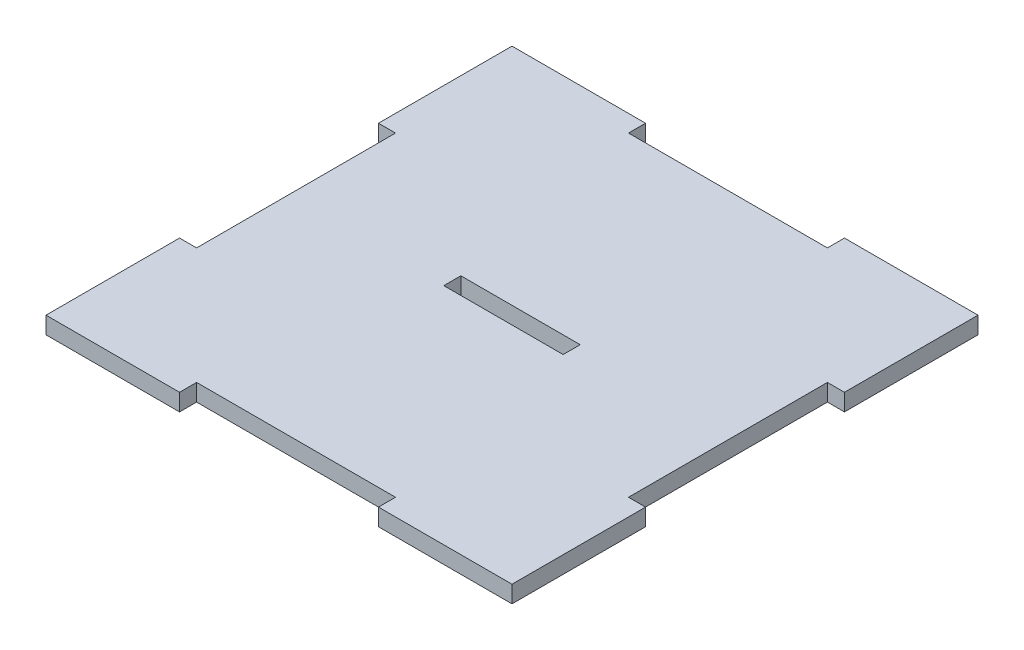
ISO-10303-21;
HEADER;
FILE_DESCRIPTION(('STEP AP214'),'2;1');
FILE_NAME('part.step','',(''),(''),'','','');
FILE_SCHEMA(('AUTOMOTIVE_DESIGN { 1 0 10303 214 1 1 1 1 }'));
ENDSEC;
DATA;
#1=APPLICATION_CONTEXT('core data for automotive mechanical design processes');
#2=APPLICATION_PROTOCOL_DEFINITION('international standard','automotive_design',2000,#1);
#3=PRODUCT_CONTEXT('',#1,'mechanical');
#4=PRODUCT('Part','Part','',(#3));
#5=PRODUCT_RELATED_PRODUCT_CATEGORY('part','',(#4));
#6=PRODUCT_DEFINITION_FORMATION('','',#4);
#7=PRODUCT_DEFINITION_CONTEXT('part definition',#1,'design');
#8=PRODUCT_DEFINITION('design','',#6,#7);
#9=PRODUCT_DEFINITION_SHAPE('','',#8);
#10=(LENGTH_UNIT() NAMED_UNIT(*) SI_UNIT(.MILLI.,.METRE.));
#11=(NAMED_UNIT(*) PLANE_ANGLE_UNIT() SI_UNIT($,.RADIAN.));
#12=(NAMED_UNIT(*) SI_UNIT($,.STERADIAN.) SOLID_ANGLE_UNIT());
#13=UNCERTAINTY_MEASURE_WITH_UNIT(LENGTH_MEASURE(1.E-05),#10,'distance_accuracy_value','');
#14=(GEOMETRIC_REPRESENTATION_CONTEXT(3) GLOBAL_UNCERTAINTY_ASSIGNED_CONTEXT((#13)) GLOBAL_UNIT_ASSIGNED_CONTEXT((#10,
#11,#12)) REPRESENTATION_CONTEXT('',''));
#15=CARTESIAN_POINT('',(0.,0.,0.));
#16=DIRECTION('',(0.,0.,1.));
#17=DIRECTION('',(1.,0.,0.));
#18=AXIS2_PLACEMENT_3D('',#15,#16,#17);
#19=CARTESIAN_POINT('',(41.,3.,-17.5));
#20=DIRECTION('',(-1.,0.,0.));
#21=DIRECTION('',(0.,0.,1.));
#22=AXIS2_PLACEMENT_3D('',#19,#20,#21);
#23=PLANE('',#22);
#24=DIRECTION('',(0.,0.,-1.));
#25=VECTOR('',#24,1.);
#26=CARTESIAN_POINT('',(41.,0.,-17.5));
#27=LINE('',#26,#25);
#28=CARTESIAN_POINT('',(41.,0.,-17.5));
#29=VERTEX_POINT('',#28);
#30=CARTESIAN_POINT('',(41.,0.,-41.));
#31=VERTEX_POINT('',#30);
#32=EDGE_CURVE('E230',#29,#31,#27,.T.);
#33=ORIENTED_EDGE('',*,*,#32,.T.);
#34=DIRECTION('',(0.,-1.,0.));
#35=VECTOR('',#34,1.);
#36=CARTESIAN_POINT('',(41.,3.,-41.));
#37=LINE('',#36,#35);
#38=CARTESIAN_POINT('',(41.,3.,-41.));
#39=VERTEX_POINT('',#38);
#40=EDGE_CURVE('E11',#39,#31,#37,.T.);
#41=ORIENTED_EDGE('',*,*,#40,.F.);
#42=DIRECTION('',(0.,0.,-1.));
#43=VECTOR('',#42,1.);
#44=CARTESIAN_POINT('',(41.,3.,-17.5));
#45=LINE('',#44,#43);
#46=CARTESIAN_POINT('',(41.,3.,-17.5));
#47=VERTEX_POINT('',#46);
#48=EDGE_CURVE('E234',#47,#39,#45,.T.);
#49=ORIENTED_EDGE('',*,*,#48,.F.);
#50=DIRECTION('',(0.,-1.,0.));
#51=VECTOR('',#50,1.);
#52=CARTESIAN_POINT('',(41.,3.,-17.5));
#53=LINE('',#52,#51);
#54=EDGE_CURVE('E276',#47,#29,#53,.T.);
#55=ORIENTED_EDGE('',*,*,#54,.T.);
#56=EDGE_LOOP('',(#33,#41,#49,#55));
#57=FACE_BOUND('',#56,.T.);
#58=ADVANCED_FACE('F37',(#57),#23,.F.);
#59=CARTESIAN_POINT('',(17.5,3.,-41.));
#60=DIRECTION('',(0.,0.,1.));
#61=DIRECTION('',(1.,0.,0.));
#62=AXIS2_PLACEMENT_3D('',#59,#60,#61);
#63=PLANE('',#62);
#64=DIRECTION('',(-1.,0.,0.));
#65=VECTOR('',#64,1.);
#66=CARTESIAN_POINT('',(17.5,0.,-41.));
#67=LINE('',#66,#65);
#68=CARTESIAN_POINT('',(17.5,0.,-41.));
#69=VERTEX_POINT('',#68);
#70=EDGE_CURVE('E279',#31,#69,#67,.T.);
#71=ORIENTED_EDGE('',*,*,#70,.T.);
#72=DIRECTION('',(0.,-1.,0.));
#73=VECTOR('',#72,1.);
#74=CARTESIAN_POINT('',(17.5,3.,-41.));
#75=LINE('',#74,#73);
#76=CARTESIAN_POINT('',(17.5,3.,-41.));
#77=VERTEX_POINT('',#76);
#78=EDGE_CURVE('E44',#77,#69,#75,.T.);
#79=ORIENTED_EDGE('',*,*,#78,.F.);
#80=DIRECTION('',(-1.,0.,0.));
#81=VECTOR('',#80,1.);
#82=CARTESIAN_POINT('',(17.5,3.,-41.));
#83=LINE('',#82,#81);
#84=EDGE_CURVE('E237',#39,#77,#83,.T.);
#85=ORIENTED_EDGE('',*,*,#84,.F.);
#86=ORIENTED_EDGE('',*,*,#40,.T.);
#87=EDGE_LOOP('',(#71,#79,#85,#86));
#88=FACE_BOUND('',#87,.T.);
#89=ADVANCED_FACE('F394',(#88),#63,.F.);
#90=CARTESIAN_POINT('',(17.5,3.,-38.));
#91=DIRECTION('',(1.,0.,0.));
#92=DIRECTION('',(0.,0.,-1.));
#93=AXIS2_PLACEMENT_3D('',#90,#91,#92);
#94=PLANE('',#93);
#95=DIRECTION('',(0.,0.,1.));
#96=VECTOR('',#95,1.);
#97=CARTESIAN_POINT('',(17.5,0.,-38.));
#98=LINE('',#97,#96);
#99=CARTESIAN_POINT('',(17.5,0.,-38.));
#100=VERTEX_POINT('',#99);
#101=EDGE_CURVE('E281',#69,#100,#98,.T.);
#102=ORIENTED_EDGE('',*,*,#101,.T.);
#103=DIRECTION('',(0.,-1.,0.));
#104=VECTOR('',#103,1.);
#105=CARTESIAN_POINT('',(17.5,3.,-38.));
#106=LINE('',#105,#104);
#107=CARTESIAN_POINT('',(17.5,3.,-38.));
#108=VERTEX_POINT('',#107);
#109=EDGE_CURVE('E366',#108,#100,#106,.T.);
#110=ORIENTED_EDGE('',*,*,#109,.F.);
#111=DIRECTION('',(0.,0.,1.));
#112=VECTOR('',#111,1.);
#113=CARTESIAN_POINT('',(17.5,3.,-38.));
#114=LINE('',#113,#112);
#115=EDGE_CURVE('E240',#77,#108,#114,.T.);
#116=ORIENTED_EDGE('',*,*,#115,.F.);
#117=ORIENTED_EDGE('',*,*,#78,.T.);
#118=EDGE_LOOP('',(#102,#110,#116,#117));
#119=FACE_BOUND('',#118,.T.);
#120=ADVANCED_FACE('F373',(#119),#94,.F.);
#121=CARTESIAN_POINT('',(-17.5,3.,-38.));
#122=DIRECTION('',(0.,0.,1.));
#123=DIRECTION('',(1.,0.,0.));
#124=AXIS2_PLACEMENT_3D('',#121,#122,#123);
#125=PLANE('',#124);
#126=DIRECTION('',(-1.,0.,0.));
#127=VECTOR('',#126,1.);
#128=CARTESIAN_POINT('',(-17.5,0.,-38.));
#129=LINE('',#128,#127);
#130=CARTESIAN_POINT('',(-17.5,0.,-38.));
#131=VERTEX_POINT('',#130);
#132=EDGE_CURVE('E283',#100,#131,#129,.T.);
#133=ORIENTED_EDGE('',*,*,#132,.T.);
#134=DIRECTION('',(0.,-1.,0.));
#135=VECTOR('',#134,1.);
#136=CARTESIAN_POINT('',(-17.5,3.,-38.));
#137=LINE('',#136,#135);
#138=CARTESIAN_POINT('',(-17.5,3.,-38.));
#139=VERTEX_POINT('',#138);
#140=EDGE_CURVE('E363',#139,#131,#137,.T.);
#141=ORIENTED_EDGE('',*,*,#140,.F.);
#142=DIRECTION('',(-1.,0.,0.));
#143=VECTOR('',#142,1.);
#144=CARTESIAN_POINT('',(-17.5,3.,-38.));
#145=LINE('',#144,#143);
#146=EDGE_CURVE('E242',#108,#139,#145,.T.);
#147=ORIENTED_EDGE('',*,*,#146,.F.);
#148=ORIENTED_EDGE('',*,*,#109,.T.);
#149=EDGE_LOOP('',(#133,#141,#147,#148));
#150=FACE_BOUND('',#149,.T.);
#151=ADVANCED_FACE('F382',(#150),#125,.F.);
#152=CARTESIAN_POINT('',(-17.5,3.,-41.));
#153=DIRECTION('',(-1.,0.,0.));
#154=DIRECTION('',(0.,0.,1.));
#155=AXIS2_PLACEMENT_3D('',#152,#153,#154);
#156=PLANE('',#155);
#157=DIRECTION('',(0.,0.,-1.));
#158=VECTOR('',#157,1.);
#159=CARTESIAN_POINT('',(-17.5,0.,-41.));
#160=LINE('',#159,#158);
#161=CARTESIAN_POINT('',(-17.5,0.,-41.));
#162=VERTEX_POINT('',#161);
#163=EDGE_CURVE('E285',#131,#162,#160,.T.);
#164=ORIENTED_EDGE('',*,*,#163,.T.);
#165=DIRECTION('',(0.,-1.,0.));
#166=VECTOR('',#165,1.);
#167=CARTESIAN_POINT('',(-17.5,3.,-41.));
#168=LINE('',#167,#166);
#169=CARTESIAN_POINT('',(-17.5,3.,-41.));
#170=VERTEX_POINT('',#169);
#171=EDGE_CURVE('E360',#170,#162,#168,.T.);
#172=ORIENTED_EDGE('',*,*,#171,.F.);
#173=DIRECTION('',(0.,0.,-1.));
#174=VECTOR('',#173,1.);
#175=CARTESIAN_POINT('',(-17.5,3.,-41.));
#176=LINE('',#175,#174);
#177=EDGE_CURVE('E244',#139,#170,#176,.T.);
#178=ORIENTED_EDGE('',*,*,#177,.F.);
#179=ORIENTED_EDGE('',*,*,#140,.T.);
#180=EDGE_LOOP('',(#164,#172,#178,#179));
#181=FACE_BOUND('',#180,.T.);
#182=ADVANCED_FACE('F386',(#181),#156,.F.);
#183=CARTESIAN_POINT('',(-41.,3.,-41.));
#184=DIRECTION('',(0.,0.,1.));
#185=DIRECTION('',(1.,0.,0.));
#186=AXIS2_PLACEMENT_3D('',#183,#184,#185);
#187=PLANE('',#186);
#188=DIRECTION('',(-1.,0.,0.));
#189=VECTOR('',#188,1.);
#190=CARTESIAN_POINT('',(-41.,0.,-41.));
#191=LINE('',#190,#189);
#192=CARTESIAN_POINT('',(-41.,0.,-41.));
#193=VERTEX_POINT('',#192);
#194=EDGE_CURVE('E287',#162,#193,#191,.T.);
#195=ORIENTED_EDGE('',*,*,#194,.T.);
#196=DIRECTION('',(0.,-1.,0.));
#197=VECTOR('',#196,1.);
#198=CARTESIAN_POINT('',(-41.,3.,-41.));
#199=LINE('',#198,#197);
#200=CARTESIAN_POINT('',(-41.,3.,-41.));
#201=VERTEX_POINT('',#200);
#202=EDGE_CURVE('E357',#201,#193,#199,.T.);
#203=ORIENTED_EDGE('',*,*,#202,.F.);
#204=DIRECTION('',(-1.,0.,0.));
#205=VECTOR('',#204,1.);
#206=CARTESIAN_POINT('',(-41.,3.,-41.));
#207=LINE('',#206,#205);
#208=EDGE_CURVE('E246',#170,#201,#207,.T.);
#209=ORIENTED_EDGE('',*,*,#208,.F.);
#210=ORIENTED_EDGE('',*,*,#171,.T.);
#211=EDGE_LOOP('',(#195,#203,#209,#210));
#212=FACE_BOUND('',#211,.T.);
#213=ADVANCED_FACE('F467',(#212),#187,.F.);
#214=CARTESIAN_POINT('',(-41.,3.,-17.5));
#215=DIRECTION('',(1.,0.,0.));
#216=DIRECTION('',(0.,0.,-1.));
#217=AXIS2_PLACEMENT_3D('',#214,#215,#216);
#218=PLANE('',#217);
#219=DIRECTION('',(0.,0.,1.));
#220=VECTOR('',#219,1.);
#221=CARTESIAN_POINT('',(-41.,0.,-17.5));
#222=LINE('',#221,#220);
#223=CARTESIAN_POINT('',(-41.,0.,-17.5));
#224=VERTEX_POINT('',#223);
#225=EDGE_CURVE('E289',#193,#224,#222,.T.);
#226=ORIENTED_EDGE('',*,*,#225,.T.);
#227=DIRECTION('',(0.,-1.,0.));
#228=VECTOR('',#227,1.);
#229=CARTESIAN_POINT('',(-41.,3.,-17.5));
#230=LINE('',#229,#228);
#231=CARTESIAN_POINT('',(-41.,3.,-17.5));
#232=VERTEX_POINT('',#231);
#233=EDGE_CURVE('E354',#232,#224,#230,.T.);
#234=ORIENTED_EDGE('',*,*,#233,.F.);
#235=DIRECTION('',(0.,0.,1.));
#236=VECTOR('',#235,1.);
#237=CARTESIAN_POINT('',(-41.,3.,-17.5));
#238=LINE('',#237,#236);
#239=EDGE_CURVE('E248',#201,#232,#238,.T.);
#240=ORIENTED_EDGE('',*,*,#239,.F.);
#241=ORIENTED_EDGE('',*,*,#202,.T.);
#242=EDGE_LOOP('',(#226,#234,#240,#241));
#243=FACE_BOUND('',#242,.T.);
#244=ADVANCED_FACE('F465',(#243),#218,.F.);
#245=CARTESIAN_POINT('',(-41.,3.,-17.5));
#246=DIRECTION('',(0.,0.,-1.));
#247=DIRECTION('',(-1.,0.,0.));
#248=AXIS2_PLACEMENT_3D('',#245,#246,#247);
#249=PLANE('',#248);
#250=DIRECTION('',(1.,0.,0.));
#251=VECTOR('',#250,1.);
#252=CARTESIAN_POINT('',(-41.,0.,-17.5));
#253=LINE('',#252,#251);
#254=CARTESIAN_POINT('',(-38.,0.,-17.5));
#255=VERTEX_POINT('',#254);
#256=EDGE_CURVE('E291',#224,#255,#253,.T.);
#257=ORIENTED_EDGE('',*,*,#256,.T.);
#258=DIRECTION('',(0.,-1.,0.));
#259=VECTOR('',#258,1.);
#260=CARTESIAN_POINT('',(-38.,3.,-17.5));
#261=LINE('',#260,#259);
#262=CARTESIAN_POINT('',(-38.,3.,-17.5));
#263=VERTEX_POINT('',#262);
#264=EDGE_CURVE('E351',#263,#255,#261,.T.);
#265=ORIENTED_EDGE('',*,*,#264,.F.);
#266=DIRECTION('',(1.,0.,0.));
#267=VECTOR('',#266,1.);
#268=CARTESIAN_POINT('',(-41.,3.,-17.5));
#269=LINE('',#268,#267);
#270=EDGE_CURVE('E250',#232,#263,#269,.T.);
#271=ORIENTED_EDGE('',*,*,#270,.F.);
#272=ORIENTED_EDGE('',*,*,#233,.T.);
#273=EDGE_LOOP('',(#257,#265,#271,#272));
#274=FACE_BOUND('',#273,.T.);
#275=ADVANCED_FACE('F460',(#274),#249,.F.);
#276=CARTESIAN_POINT('',(-38.,3.,-17.5));
#277=DIRECTION('',(1.,0.,0.));
#278=DIRECTION('',(0.,0.,-1.));
#279=AXIS2_PLACEMENT_3D('',#276,#277,#278);
#280=PLANE('',#279);
#281=DIRECTION('',(0.,0.,1.));
#282=VECTOR('',#281,1.);
#283=CARTESIAN_POINT('',(-38.,0.,-17.5));
#284=LINE('',#283,#282);
#285=CARTESIAN_POINT('',(-38.,0.,17.5));
#286=VERTEX_POINT('',#285);
#287=EDGE_CURVE('E293',#255,#286,#284,.T.);
#288=ORIENTED_EDGE('',*,*,#287,.T.);
#289=DIRECTION('',(0.,-1.,0.));
#290=VECTOR('',#289,1.);
#291=CARTESIAN_POINT('',(-38.,3.,17.5));
#292=LINE('',#291,#290);
#293=CARTESIAN_POINT('',(-38.,3.,17.5));
#294=VERTEX_POINT('',#293);
#295=EDGE_CURVE('E348',#294,#286,#292,.T.);
#296=ORIENTED_EDGE('',*,*,#295,.F.);
#297=DIRECTION('',(0.,0.,1.));
#298=VECTOR('',#297,1.);
#299=CARTESIAN_POINT('',(-38.,3.,-17.5));
#300=LINE('',#299,#298);
#301=EDGE_CURVE('E252',#263,#294,#300,.T.);
#302=ORIENTED_EDGE('',*,*,#301,.F.);
#303=ORIENTED_EDGE('',*,*,#264,.T.);
#304=EDGE_LOOP('',(#288,#296,#302,#303));
#305=FACE_BOUND('',#304,.T.);
#306=ADVANCED_FACE('F455',(#305),#280,.F.);
#307=CARTESIAN_POINT('',(-38.,3.,17.5));
#308=DIRECTION('',(0.,0.,1.));
#309=DIRECTION('',(1.,0.,0.));
#310=AXIS2_PLACEMENT_3D('',#307,#308,#309);
#311=PLANE('',#310);
#312=DIRECTION('',(-1.,0.,0.));
#313=VECTOR('',#312,1.);
#314=CARTESIAN_POINT('',(-38.,0.,17.5));
#315=LINE('',#314,#313);
#316=CARTESIAN_POINT('',(-41.,0.,17.5));
#317=VERTEX_POINT('',#316);
#318=EDGE_CURVE('E295',#286,#317,#315,.T.);
#319=ORIENTED_EDGE('',*,*,#318,.T.);
#320=DIRECTION('',(0.,-1.,0.));
#321=VECTOR('',#320,1.);
#322=CARTESIAN_POINT('',(-41.,3.,17.5));
#323=LINE('',#322,#321);
#324=CARTESIAN_POINT('',(-41.,3.,17.5));
#325=VERTEX_POINT('',#324);
#326=EDGE_CURVE('E345',#325,#317,#323,.T.);
#327=ORIENTED_EDGE('',*,*,#326,.F.);
#328=DIRECTION('',(-1.,0.,0.));
#329=VECTOR('',#328,1.);
#330=CARTESIAN_POINT('',(-38.,3.,17.5));
#331=LINE('',#330,#329);
#332=EDGE_CURVE('E254',#294,#325,#331,.T.);
#333=ORIENTED_EDGE('',*,*,#332,.F.);
#334=ORIENTED_EDGE('',*,*,#295,.T.);
#335=EDGE_LOOP('',(#319,#327,#333,#334));
#336=FACE_BOUND('',#335,.T.);
#337=ADVANCED_FACE('F451',(#336),#311,.F.);
#338=CARTESIAN_POINT('',(-41.,3.,41.));
#339=DIRECTION('',(1.,0.,0.));
#340=DIRECTION('',(0.,0.,-1.));
#341=AXIS2_PLACEMENT_3D('',#338,#339,#340);
#342=PLANE('',#341);
#343=DIRECTION('',(0.,0.,1.));
#344=VECTOR('',#343,1.);
#345=CARTESIAN_POINT('',(-41.,0.,41.));
#346=LINE('',#345,#344);
#347=CARTESIAN_POINT('',(-41.,0.,41.));
#348=VERTEX_POINT('',#347);
#349=EDGE_CURVE('E297',#317,#348,#346,.T.);
#350=ORIENTED_EDGE('',*,*,#349,.T.);
#351=DIRECTION('',(0.,-1.,0.));
#352=VECTOR('',#351,1.);
#353=CARTESIAN_POINT('',(-41.,3.,41.));
#354=LINE('',#353,#352);
#355=CARTESIAN_POINT('',(-41.,3.,41.));
#356=VERTEX_POINT('',#355);
#357=EDGE_CURVE('E342',#356,#348,#354,.T.);
#358=ORIENTED_EDGE('',*,*,#357,.F.);
#359=DIRECTION('',(0.,0.,1.));
#360=VECTOR('',#359,1.);
#361=CARTESIAN_POINT('',(-41.,3.,41.));
#362=LINE('',#361,#360);
#363=EDGE_CURVE('E256',#325,#356,#362,.T.);
#364=ORIENTED_EDGE('',*,*,#363,.F.);
#365=ORIENTED_EDGE('',*,*,#326,.T.);
#366=EDGE_LOOP('',(#350,#358,#364,#365));
#367=FACE_BOUND('',#366,.T.);
#368=ADVANCED_FACE('F446',(#367),#342,.F.);
#369=CARTESIAN_POINT('',(-41.,3.,41.));
#370=DIRECTION('',(0.,0.,-1.));
#371=DIRECTION('',(-1.,0.,0.));
#372=AXIS2_PLACEMENT_3D('',#369,#370,#371);
#373=PLANE('',#372);
#374=DIRECTION('',(1.,0.,0.));
#375=VECTOR('',#374,1.);
#376=CARTESIAN_POINT('',(-41.,0.,41.));
#377=LINE('',#376,#375);
#378=CARTESIAN_POINT('',(-17.5,0.,41.));
#379=VERTEX_POINT('',#378);
#380=EDGE_CURVE('E299',#348,#379,#377,.T.);
#381=ORIENTED_EDGE('',*,*,#380,.T.);
#382=DIRECTION('',(0.,-1.,0.));
#383=VECTOR('',#382,1.);
#384=CARTESIAN_POINT('',(-17.5,3.,41.));
#385=LINE('',#384,#383);
#386=CARTESIAN_POINT('',(-17.5,3.,41.));
#387=VERTEX_POINT('',#386);
#388=EDGE_CURVE('E339',#387,#379,#385,.T.);
#389=ORIENTED_EDGE('',*,*,#388,.F.);
#390=DIRECTION('',(1.,0.,0.));
#391=VECTOR('',#390,1.);
#392=CARTESIAN_POINT('',(-41.,3.,41.));
#393=LINE('',#392,#391);
#394=EDGE_CURVE('E258',#356,#387,#393,.T.);
#395=ORIENTED_EDGE('',*,*,#394,.F.);
#396=ORIENTED_EDGE('',*,*,#357,.T.);
#397=EDGE_LOOP('',(#381,#389,#395,#396));
#398=FACE_BOUND('',#397,.T.);
#399=ADVANCED_FACE('F440',(#398),#373,.F.);
#400=CARTESIAN_POINT('',(-17.5,3.,38.));
#401=DIRECTION('',(-1.,0.,0.));
#402=DIRECTION('',(0.,0.,1.));
#403=AXIS2_PLACEMENT_3D('',#400,#401,#402);
#404=PLANE('',#403);
#405=DIRECTION('',(0.,0.,-1.));
#406=VECTOR('',#405,1.);
#407=CARTESIAN_POINT('',(-17.5,0.,38.));
#408=LINE('',#407,#406);
#409=CARTESIAN_POINT('',(-17.5,0.,38.));
#410=VERTEX_POINT('',#409);
#411=EDGE_CURVE('E301',#379,#410,#408,.T.);
#412=ORIENTED_EDGE('',*,*,#411,.T.);
#413=DIRECTION('',(0.,-1.,0.));
#414=VECTOR('',#413,1.);
#415=CARTESIAN_POINT('',(-17.5,3.,38.));
#416=LINE('',#415,#414);
#417=CARTESIAN_POINT('',(-17.5,3.,38.));
#418=VERTEX_POINT('',#417);
#419=EDGE_CURVE('E336',#418,#410,#416,.T.);
#420=ORIENTED_EDGE('',*,*,#419,.F.);
#421=DIRECTION('',(0.,0.,-1.));
#422=VECTOR('',#421,1.);
#423=CARTESIAN_POINT('',(-17.5,3.,38.));
#424=LINE('',#423,#422);
#425=EDGE_CURVE('E260',#387,#418,#424,.T.);
#426=ORIENTED_EDGE('',*,*,#425,.F.);
#427=ORIENTED_EDGE('',*,*,#388,.T.);
#428=EDGE_LOOP('',(#412,#420,#426,#427));
#429=FACE_BOUND('',#428,.T.);
#430=ADVANCED_FACE('F436',(#429),#404,.F.);
#431=CARTESIAN_POINT('',(17.5,3.,38.));
#432=DIRECTION('',(0.,0.,-1.));
#433=DIRECTION('',(-1.,0.,0.));
#434=AXIS2_PLACEMENT_3D('',#431,#432,#433);
#435=PLANE('',#434);
#436=DIRECTION('',(1.,0.,0.));
#437=VECTOR('',#436,1.);
#438=CARTESIAN_POINT('',(17.5,0.,38.));
#439=LINE('',#438,#437);
#440=CARTESIAN_POINT('',(17.5,0.,38.));
#441=VERTEX_POINT('',#440);
#442=EDGE_CURVE('E303',#410,#441,#439,.T.);
#443=ORIENTED_EDGE('',*,*,#442,.T.);
#444=DIRECTION('',(0.,-1.,0.));
#445=VECTOR('',#444,1.);
#446=CARTESIAN_POINT('',(17.5,3.,38.));
#447=LINE('',#446,#445);
#448=CARTESIAN_POINT('',(17.5,3.,38.));
#449=VERTEX_POINT('',#448);
#450=EDGE_CURVE('E333',#449,#441,#447,.T.);
#451=ORIENTED_EDGE('',*,*,#450,.F.);
#452=DIRECTION('',(1.,0.,0.));
#453=VECTOR('',#452,1.);
#454=CARTESIAN_POINT('',(17.5,3.,38.));
#455=LINE('',#454,#453);
#456=EDGE_CURVE('E262',#418,#449,#455,.T.);
#457=ORIENTED_EDGE('',*,*,#456,.F.);
#458=ORIENTED_EDGE('',*,*,#419,.T.);
#459=EDGE_LOOP('',(#443,#451,#457,#458));
#460=FACE_BOUND('',#459,.T.);
#461=ADVANCED_FACE('F431',(#460),#435,.F.);
#462=CARTESIAN_POINT('',(17.5,3.,41.));
#463=DIRECTION('',(1.,0.,0.));
#464=DIRECTION('',(0.,0.,-1.));
#465=AXIS2_PLACEMENT_3D('',#462,#463,#464);
#466=PLANE('',#465);
#467=DIRECTION('',(0.,0.,1.));
#468=VECTOR('',#467,1.);
#469=CARTESIAN_POINT('',(17.5,0.,41.));
#470=LINE('',#469,#468);
#471=CARTESIAN_POINT('',(17.5,0.,41.));
#472=VERTEX_POINT('',#471);
#473=EDGE_CURVE('E305',#441,#472,#470,.T.);
#474=ORIENTED_EDGE('',*,*,#473,.T.);
#475=DIRECTION('',(0.,-1.,0.));
#476=VECTOR('',#475,1.);
#477=CARTESIAN_POINT('',(17.5,3.,41.));
#478=LINE('',#477,#476);
#479=CARTESIAN_POINT('',(17.5,3.,41.));
#480=VERTEX_POINT('',#479);
#481=EDGE_CURVE('E330',#480,#472,#478,.T.);
#482=ORIENTED_EDGE('',*,*,#481,.F.);
#483=DIRECTION('',(0.,0.,1.));
#484=VECTOR('',#483,1.);
#485=CARTESIAN_POINT('',(17.5,3.,41.));
#486=LINE('',#485,#484);
#487=EDGE_CURVE('E264',#449,#480,#486,.T.);
#488=ORIENTED_EDGE('',*,*,#487,.F.);
#489=ORIENTED_EDGE('',*,*,#450,.T.);
#490=EDGE_LOOP('',(#474,#482,#488,#489));
#491=FACE_BOUND('',#490,.T.);
#492=ADVANCED_FACE('F425',(#491),#466,.F.);
#493=CARTESIAN_POINT('',(17.5,3.,41.));
#494=DIRECTION('',(0.,0.,-1.));
#495=DIRECTION('',(-1.,0.,0.));
#496=AXIS2_PLACEMENT_3D('',#493,#494,#495);
#497=PLANE('',#496);
#498=DIRECTION('',(1.,0.,0.));
#499=VECTOR('',#498,1.);
#500=CARTESIAN_POINT('',(17.5,0.,41.));
#501=LINE('',#500,#499);
#502=CARTESIAN_POINT('',(41.,0.,41.));
#503=VERTEX_POINT('',#502);
#504=EDGE_CURVE('E307',#472,#503,#501,.T.);
#505=ORIENTED_EDGE('',*,*,#504,.T.);
#506=DIRECTION('',(0.,-1.,0.));
#507=VECTOR('',#506,1.);
#508=CARTESIAN_POINT('',(41.,3.,41.));
#509=LINE('',#508,#507);
#510=CARTESIAN_POINT('',(41.,3.,41.));
#511=VERTEX_POINT('',#510);
#512=EDGE_CURVE('E327',#511,#503,#509,.T.);
#513=ORIENTED_EDGE('',*,*,#512,.F.);
#514=DIRECTION('',(1.,0.,0.));
#515=VECTOR('',#514,1.);
#516=CARTESIAN_POINT('',(17.5,3.,41.));
#517=LINE('',#516,#515);
#518=EDGE_CURVE('E266',#480,#511,#517,.T.);
#519=ORIENTED_EDGE('',*,*,#518,.F.);
#520=ORIENTED_EDGE('',*,*,#481,.T.);
#521=EDGE_LOOP('',(#505,#513,#519,#520));
#522=FACE_BOUND('',#521,.T.);
#523=ADVANCED_FACE('F421',(#522),#497,.F.);
#524=CARTESIAN_POINT('',(41.,3.,41.));
#525=DIRECTION('',(-1.,0.,0.));
#526=DIRECTION('',(0.,0.,1.));
#527=AXIS2_PLACEMENT_3D('',#524,#525,#526);
#528=PLANE('',#527);
#529=DIRECTION('',(0.,0.,-1.));
#530=VECTOR('',#529,1.);
#531=CARTESIAN_POINT('',(41.,0.,41.));
#532=LINE('',#531,#530);
#533=CARTESIAN_POINT('',(41.,0.,17.5));
#534=VERTEX_POINT('',#533);
#535=EDGE_CURVE('E309',#503,#534,#532,.T.);
#536=ORIENTED_EDGE('',*,*,#535,.T.);
#537=DIRECTION('',(0.,-1.,0.));
#538=VECTOR('',#537,1.);
#539=CARTESIAN_POINT('',(41.,3.,17.5));
#540=LINE('',#539,#538);
#541=CARTESIAN_POINT('',(41.,3.,17.5));
#542=VERTEX_POINT('',#541);
#543=EDGE_CURVE('E324',#542,#534,#540,.T.);
#544=ORIENTED_EDGE('',*,*,#543,.F.);
#545=DIRECTION('',(0.,0.,-1.));
#546=VECTOR('',#545,1.);
#547=CARTESIAN_POINT('',(41.,3.,41.));
#548=LINE('',#547,#546);
#549=EDGE_CURVE('E268',#511,#542,#548,.T.);
#550=ORIENTED_EDGE('',*,*,#549,.F.);
#551=ORIENTED_EDGE('',*,*,#512,.T.);
#552=EDGE_LOOP('',(#536,#544,#550,#551));
#553=FACE_BOUND('',#552,.T.);
#554=ADVANCED_FACE('F416',(#553),#528,.F.);
#555=CARTESIAN_POINT('',(38.,3.,17.5));
#556=DIRECTION('',(0.,0.,1.));
#557=DIRECTION('',(1.,0.,0.));
#558=AXIS2_PLACEMENT_3D('',#555,#556,#557);
#559=PLANE('',#558);
#560=DIRECTION('',(-1.,0.,0.));
#561=VECTOR('',#560,1.);
#562=CARTESIAN_POINT('',(38.,0.,17.5));
#563=LINE('',#562,#561);
#564=CARTESIAN_POINT('',(38.,0.,17.5));
#565=VERTEX_POINT('',#564);
#566=EDGE_CURVE('E311',#534,#565,#563,.T.);
#567=ORIENTED_EDGE('',*,*,#566,.T.);
#568=DIRECTION('',(0.,-1.,0.));
#569=VECTOR('',#568,1.);
#570=CARTESIAN_POINT('',(38.,3.,17.5));
#571=LINE('',#570,#569);
#572=CARTESIAN_POINT('',(38.,3.,17.5));
#573=VERTEX_POINT('',#572);
#574=EDGE_CURVE('E321',#573,#565,#571,.T.);
#575=ORIENTED_EDGE('',*,*,#574,.F.);
#576=DIRECTION('',(-1.,0.,0.));
#577=VECTOR('',#576,1.);
#578=CARTESIAN_POINT('',(38.,3.,17.5));
#579=LINE('',#578,#577);
#580=EDGE_CURVE('E270',#542,#573,#579,.T.);
#581=ORIENTED_EDGE('',*,*,#580,.F.);
#582=ORIENTED_EDGE('',*,*,#543,.T.);
#583=EDGE_LOOP('',(#567,#575,#581,#582));
#584=FACE_BOUND('',#583,.T.);
#585=ADVANCED_FACE('F410',(#584),#559,.F.);
#586=CARTESIAN_POINT('',(38.,3.,-17.5));
#587=DIRECTION('',(-1.,0.,0.));
#588=DIRECTION('',(0.,0.,1.));
#589=AXIS2_PLACEMENT_3D('',#586,#587,#588);
#590=PLANE('',#589);
#591=DIRECTION('',(0.,0.,-1.));
#592=VECTOR('',#591,1.);
#593=CARTESIAN_POINT('',(38.,0.,-17.5));
#594=LINE('',#593,#592);
#595=CARTESIAN_POINT('',(38.,0.,-17.5));
#596=VERTEX_POINT('',#595);
#597=EDGE_CURVE('E313',#565,#596,#594,.T.);
#598=ORIENTED_EDGE('',*,*,#597,.T.);
#599=DIRECTION('',(0.,-1.,0.));
#600=VECTOR('',#599,1.);
#601=CARTESIAN_POINT('',(38.,3.,-17.5));
#602=LINE('',#601,#600);
#603=CARTESIAN_POINT('',(38.,3.,-17.5));
#604=VERTEX_POINT('',#603);
#605=EDGE_CURVE('E318',#604,#596,#602,.T.);
#606=ORIENTED_EDGE('',*,*,#605,.F.);
#607=DIRECTION('',(0.,0.,-1.));
#608=VECTOR('',#607,1.);
#609=CARTESIAN_POINT('',(38.,3.,-17.5));
#610=LINE('',#609,#608);
#611=EDGE_CURVE('E272',#573,#604,#610,.T.);
#612=ORIENTED_EDGE('',*,*,#611,.F.);
#613=ORIENTED_EDGE('',*,*,#574,.T.);
#614=EDGE_LOOP('',(#598,#606,#612,#613));
#615=FACE_BOUND('',#614,.T.);
#616=ADVANCED_FACE('F406',(#615),#590,.F.);
#617=CARTESIAN_POINT('',(41.,3.,-17.5));
#618=DIRECTION('',(0.,0.,-1.));
#619=DIRECTION('',(-1.,0.,0.));
#620=AXIS2_PLACEMENT_3D('',#617,#618,#619);
#621=PLANE('',#620);
#622=DIRECTION('',(1.,0.,0.));
#623=VECTOR('',#622,1.);
#624=CARTESIAN_POINT('',(41.,0.,-17.5));
#625=LINE('',#624,#623);
#626=EDGE_CURVE('E238',#596,#29,#625,.T.);
#627=ORIENTED_EDGE('',*,*,#626,.T.);
#628=ORIENTED_EDGE('',*,*,#54,.F.);
#629=DIRECTION('',(1.,0.,0.));
#630=VECTOR('',#629,1.);
#631=CARTESIAN_POINT('',(41.,3.,-17.5));
#632=LINE('',#631,#630);
#633=EDGE_CURVE('E274',#604,#47,#632,.T.);
#634=ORIENTED_EDGE('',*,*,#633,.F.);
#635=ORIENTED_EDGE('',*,*,#605,.T.);
#636=EDGE_LOOP('',(#627,#628,#634,#635));
#637=FACE_BOUND('',#636,.T.);
#638=ADVANCED_FACE('F401',(#637),#621,.F.);
#639=CARTESIAN_POINT('',(0.,3.,0.));
#640=DIRECTION('',(0.,-1.,0.));
#641=DIRECTION('',(0.,0.,-1.));
#642=AXIS2_PLACEMENT_3D('',#639,#640,#641);
#643=PLANE('',#642);
#644=DIRECTION('',(-1.,0.,0.));
#645=VECTOR('',#644,1.);
#646=CARTESIAN_POINT('',(-10.5,3.,-1.5));
#647=LINE('',#646,#645);
#648=CARTESIAN_POINT('',(10.5,3.,-1.5));
#649=VERTEX_POINT('',#648);
#650=CARTESIAN_POINT('',(-10.5,3.,-1.5));
#651=VERTEX_POINT('',#650);
#652=EDGE_CURVE('E224',#649,#651,#647,.T.);
#653=ORIENTED_EDGE('',*,*,#652,.F.);
#654=DIRECTION('',(0.,0.,-1.));
#655=VECTOR('',#654,1.);
#656=CARTESIAN_POINT('',(10.5,3.,-1.5));
#657=LINE('',#656,#655);
#658=CARTESIAN_POINT('',(10.5,3.,1.5));
#659=VERTEX_POINT('',#658);
#660=EDGE_CURVE('E51',#659,#649,#657,.T.);
#661=ORIENTED_EDGE('',*,*,#660,.F.);
#662=DIRECTION('',(1.,0.,0.));
#663=VECTOR('',#662,1.);
#664=CARTESIAN_POINT('',(-10.5,3.,1.5));
#665=LINE('',#664,#663);
#666=CARTESIAN_POINT('',(-10.5,3.,1.5));
#667=VERTEX_POINT('',#666);
#668=EDGE_CURVE('E215',#667,#659,#665,.T.);
#669=ORIENTED_EDGE('',*,*,#668,.F.);
#670=DIRECTION('',(0.,0.,1.));
#671=VECTOR('',#670,1.);
#672=CARTESIAN_POINT('',(-10.5,3.,-1.5));
#673=LINE('',#672,#671);
#674=EDGE_CURVE('E218',#651,#667,#673,.T.);
#675=ORIENTED_EDGE('',*,*,#674,.F.);
#676=EDGE_LOOP('',(#653,#661,#669,#675));
#677=FACE_BOUND('',#676,.T.);
#678=ORIENTED_EDGE('',*,*,#48,.T.);
#679=ORIENTED_EDGE('',*,*,#84,.T.);
#680=ORIENTED_EDGE('',*,*,#115,.T.);
#681=ORIENTED_EDGE('',*,*,#146,.T.);
#682=ORIENTED_EDGE('',*,*,#177,.T.);
#683=ORIENTED_EDGE('',*,*,#208,.T.);
#684=ORIENTED_EDGE('',*,*,#239,.T.);
#685=ORIENTED_EDGE('',*,*,#270,.T.);
#686=ORIENTED_EDGE('',*,*,#301,.T.);
#687=ORIENTED_EDGE('',*,*,#332,.T.);
#688=ORIENTED_EDGE('',*,*,#363,.T.);
#689=ORIENTED_EDGE('',*,*,#394,.T.);
#690=ORIENTED_EDGE('',*,*,#425,.T.);
#691=ORIENTED_EDGE('',*,*,#456,.T.);
#692=ORIENTED_EDGE('',*,*,#487,.T.);
#693=ORIENTED_EDGE('',*,*,#518,.T.);
#694=ORIENTED_EDGE('',*,*,#549,.T.);
#695=ORIENTED_EDGE('',*,*,#580,.T.);
#696=ORIENTED_EDGE('',*,*,#611,.T.);
#697=ORIENTED_EDGE('',*,*,#633,.T.);
#698=EDGE_LOOP('',(#678,#679,#680,#681,#682,#683,#684,#685,#686,#687,#688,#689,#690,#691,#692,
#693,#694,#695,#696,#697));
#699=FACE_BOUND('',#698,.T.);
#700=ADVANCED_FACE('F390',(#677,#699),#643,.F.);
#701=CARTESIAN_POINT('',(0.,0.,0.));
#702=DIRECTION('',(0.,-1.,0.));
#703=DIRECTION('',(0.,0.,-1.));
#704=AXIS2_PLACEMENT_3D('',#701,#702,#703);
#705=PLANE('',#704);
#706=DIRECTION('',(0.,0.,-1.));
#707=VECTOR('',#706,1.);
#708=CARTESIAN_POINT('',(10.5,0.,-1.5));
#709=LINE('',#708,#707);
#710=CARTESIAN_POINT('',(10.5,0.,1.5));
#711=VERTEX_POINT('',#710);
#712=CARTESIAN_POINT('',(10.5,0.,-1.5));
#713=VERTEX_POINT('',#712);
#714=EDGE_CURVE('E199',#711,#713,#709,.T.);
#715=ORIENTED_EDGE('',*,*,#714,.T.);
#716=DIRECTION('',(-1.,0.,0.));
#717=VECTOR('',#716,1.);
#718=CARTESIAN_POINT('',(-10.5,0.,-1.5));
#719=LINE('',#718,#717);
#720=CARTESIAN_POINT('',(-10.5,0.,-1.5));
#721=VERTEX_POINT('',#720);
#722=EDGE_CURVE('E208',#713,#721,#719,.T.);
#723=ORIENTED_EDGE('',*,*,#722,.T.);
#724=DIRECTION('',(0.,0.,1.));
#725=VECTOR('',#724,1.);
#726=CARTESIAN_POINT('',(-10.5,0.,-1.5));
#727=LINE('',#726,#725);
#728=CARTESIAN_POINT('',(-10.5,0.,1.5));
#729=VERTEX_POINT('',#728);
#730=EDGE_CURVE('E59',#721,#729,#727,.T.);
#731=ORIENTED_EDGE('',*,*,#730,.T.);
#732=DIRECTION('',(1.,0.,0.));
#733=VECTOR('',#732,1.);
#734=CARTESIAN_POINT('',(-10.5,0.,1.5));
#735=LINE('',#734,#733);
#736=EDGE_CURVE('E205',#729,#711,#735,.T.);
#737=ORIENTED_EDGE('',*,*,#736,.T.);
#738=EDGE_LOOP('',(#715,#723,#731,#737));
#739=FACE_BOUND('',#738,.T.);
#740=ORIENTED_EDGE('',*,*,#32,.F.);
#741=ORIENTED_EDGE('',*,*,#626,.F.);
#742=ORIENTED_EDGE('',*,*,#597,.F.);
#743=ORIENTED_EDGE('',*,*,#566,.F.);
#744=ORIENTED_EDGE('',*,*,#535,.F.);
#745=ORIENTED_EDGE('',*,*,#504,.F.);
#746=ORIENTED_EDGE('',*,*,#473,.F.);
#747=ORIENTED_EDGE('',*,*,#442,.F.);
#748=ORIENTED_EDGE('',*,*,#411,.F.);
#749=ORIENTED_EDGE('',*,*,#380,.F.);
#750=ORIENTED_EDGE('',*,*,#349,.F.);
#751=ORIENTED_EDGE('',*,*,#318,.F.);
#752=ORIENTED_EDGE('',*,*,#287,.F.);
#753=ORIENTED_EDGE('',*,*,#256,.F.);
#754=ORIENTED_EDGE('',*,*,#225,.F.);
#755=ORIENTED_EDGE('',*,*,#194,.F.);
#756=ORIENTED_EDGE('',*,*,#163,.F.);
#757=ORIENTED_EDGE('',*,*,#132,.F.);
#758=ORIENTED_EDGE('',*,*,#101,.F.);
#759=ORIENTED_EDGE('',*,*,#70,.F.);
#760=EDGE_LOOP('',(#740,#741,#742,#743,#744,#745,#746,#747,#748,#749,#750,#751,#752,#753,#754,
#755,#756,#757,#758,#759));
#761=FACE_BOUND('',#760,.T.);
#762=ADVANCED_FACE('F212',(#739,#761),#705,.T.);
#763=CARTESIAN_POINT('',(10.5,0.,-1.5));
#764=DIRECTION('',(1.,0.,0.));
#765=DIRECTION('',(0.,0.,-1.));
#766=AXIS2_PLACEMENT_3D('',#763,#764,#765);
#767=PLANE('',#766);
#768=ORIENTED_EDGE('',*,*,#660,.T.);
#769=DIRECTION('',(0.,1.,0.));
#770=VECTOR('',#769,1.);
#771=CARTESIAN_POINT('',(10.5,0.,-1.5));
#772=LINE('',#771,#770);
#773=EDGE_CURVE('E195',#713,#649,#772,.T.);
#774=ORIENTED_EDGE('',*,*,#773,.F.);
#775=ORIENTED_EDGE('',*,*,#714,.F.);
#776=DIRECTION('',(0.,1.,0.));
#777=VECTOR('',#776,1.);
#778=CARTESIAN_POINT('',(10.5,0.,1.5));
#779=LINE('',#778,#777);
#780=EDGE_CURVE('E228',#711,#659,#779,.T.);
#781=ORIENTED_EDGE('',*,*,#780,.T.);
#782=EDGE_LOOP('',(#768,#774,#775,#781));
#783=FACE_BOUND('',#782,.T.);
#784=ADVANCED_FACE('F197',(#783),#767,.F.);
#785=CARTESIAN_POINT('',(-10.5,0.,1.5));
#786=DIRECTION('',(0.,0.,1.));
#787=DIRECTION('',(1.,0.,0.));
#788=AXIS2_PLACEMENT_3D('',#785,#786,#787);
#789=PLANE('',#788);
#790=ORIENTED_EDGE('',*,*,#668,.T.);
#791=ORIENTED_EDGE('',*,*,#780,.F.);
#792=ORIENTED_EDGE('',*,*,#736,.F.);
#793=DIRECTION('',(0.,1.,0.));
#794=VECTOR('',#793,1.);
#795=CARTESIAN_POINT('',(-10.5,0.,1.5));
#796=LINE('',#795,#794);
#797=EDGE_CURVE('E231',#729,#667,#796,.T.);
#798=ORIENTED_EDGE('',*,*,#797,.T.);
#799=EDGE_LOOP('',(#790,#791,#792,#798));
#800=FACE_BOUND('',#799,.T.);
#801=ADVANCED_FACE('F634',(#800),#789,.F.);
#802=CARTESIAN_POINT('',(-10.5,0.,-1.5));
#803=DIRECTION('',(-1.,0.,0.));
#804=DIRECTION('',(0.,0.,1.));
#805=AXIS2_PLACEMENT_3D('',#802,#803,#804);
#806=PLANE('',#805);
#807=ORIENTED_EDGE('',*,*,#674,.T.);
#808=ORIENTED_EDGE('',*,*,#797,.F.);
#809=ORIENTED_EDGE('',*,*,#730,.F.);
#810=DIRECTION('',(0.,1.,0.));
#811=VECTOR('',#810,1.);
#812=CARTESIAN_POINT('',(-10.5,0.,-1.5));
#813=LINE('',#812,#811);
#814=EDGE_CURVE('E204',#721,#651,#813,.T.);
#815=ORIENTED_EDGE('',*,*,#814,.T.);
#816=EDGE_LOOP('',(#807,#808,#809,#815));
#817=FACE_BOUND('',#816,.T.);
#818=ADVANCED_FACE('F643',(#817),#806,.F.);
#819=CARTESIAN_POINT('',(-10.5,0.,-1.5));
#820=DIRECTION('',(0.,0.,-1.));
#821=DIRECTION('',(-1.,0.,0.));
#822=AXIS2_PLACEMENT_3D('',#819,#820,#821);
#823=PLANE('',#822);
#824=ORIENTED_EDGE('',*,*,#652,.T.);
#825=ORIENTED_EDGE('',*,*,#814,.F.);
#826=ORIENTED_EDGE('',*,*,#722,.F.);
#827=ORIENTED_EDGE('',*,*,#773,.T.);
#828=EDGE_LOOP('',(#824,#825,#826,#827));
#829=FACE_BOUND('',#828,.T.);
#830=ADVANCED_FACE('F209',(#829),#823,.F.);
#831=CLOSED_SHELL('',(#58,#89,#120,#151,#182,#213,#244,#275,#306,#337,#368,#399,#430,#461,#492,
#523,#554,#585,#616,#638,#700,#762,#784,#801,#818,#830));
#832=MANIFOLD_SOLID_BREP('B2',#831);
#833=ADVANCED_BREP_SHAPE_REPRESENTATION('',(#18,#832),#14);
#834=SHAPE_DEFINITION_REPRESENTATION(#9,#833);
ENDSEC;
END-ISO-10303-21;
